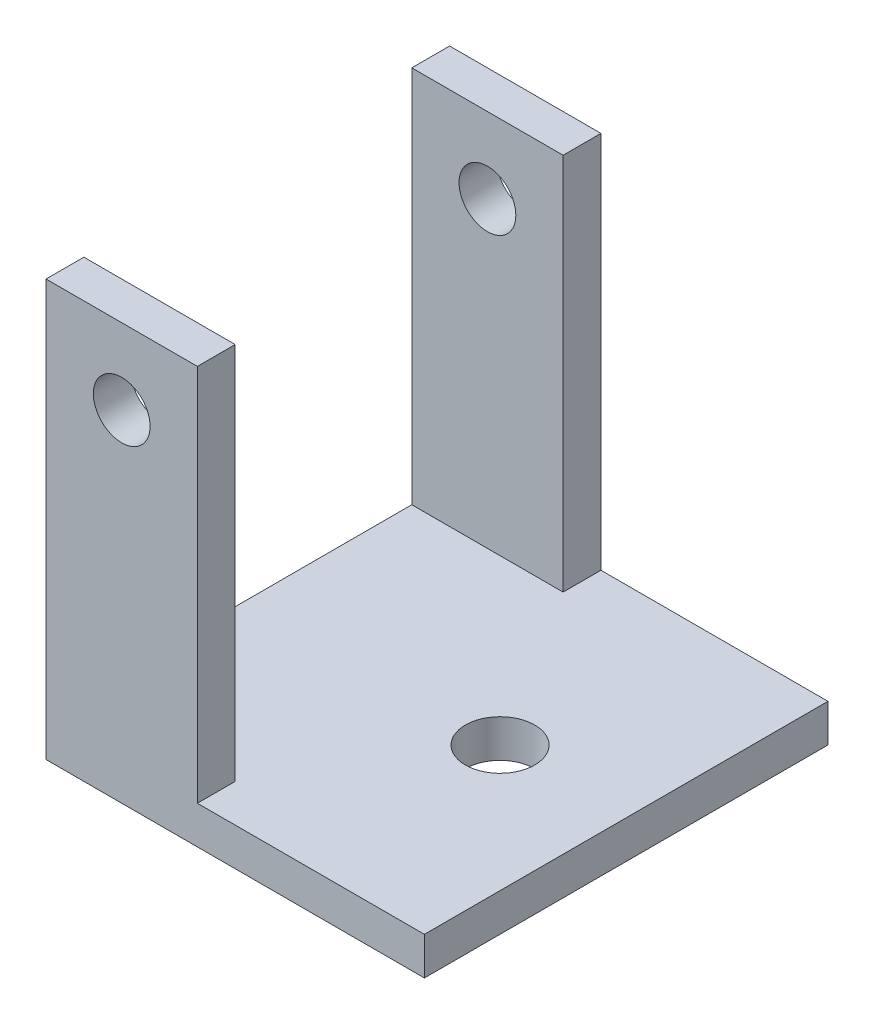
ISO-10303-21;
HEADER;
FILE_DESCRIPTION(('STEP AP214'),'2;1');
FILE_NAME('part.step','',(''),(''),'','','');
FILE_SCHEMA(('AUTOMOTIVE_DESIGN { 1 0 10303 214 1 1 1 1 }'));
ENDSEC;
DATA;
#1=APPLICATION_CONTEXT('core data for automotive mechanical design processes');
#2=APPLICATION_PROTOCOL_DEFINITION('international standard','automotive_design',2000,#1);
#3=PRODUCT_CONTEXT('',#1,'mechanical');
#4=PRODUCT('Part','Part','',(#3));
#5=PRODUCT_RELATED_PRODUCT_CATEGORY('part','',(#4));
#6=PRODUCT_DEFINITION_FORMATION('','',#4);
#7=PRODUCT_DEFINITION_CONTEXT('part definition',#1,'design');
#8=PRODUCT_DEFINITION('design','',#6,#7);
#9=PRODUCT_DEFINITION_SHAPE('','',#8);
#10=(LENGTH_UNIT() NAMED_UNIT(*) SI_UNIT(.MILLI.,.METRE.));
#11=(NAMED_UNIT(*) PLANE_ANGLE_UNIT() SI_UNIT($,.RADIAN.));
#12=(NAMED_UNIT(*) SI_UNIT($,.STERADIAN.) SOLID_ANGLE_UNIT());
#13=UNCERTAINTY_MEASURE_WITH_UNIT(LENGTH_MEASURE(1.E-05),#10,'distance_accuracy_value','');
#14=(GEOMETRIC_REPRESENTATION_CONTEXT(3) GLOBAL_UNCERTAINTY_ASSIGNED_CONTEXT((#13)) GLOBAL_UNIT_ASSIGNED_CONTEXT((#10,
#11,#12)) REPRESENTATION_CONTEXT('',''));
#15=CARTESIAN_POINT('',(0.,0.,0.));
#16=DIRECTION('',(0.,0.,1.));
#17=DIRECTION('',(1.,0.,0.));
#18=AXIS2_PLACEMENT_3D('',#15,#16,#17);
#19=CARTESIAN_POINT('',(0.,0.,0.));
#20=DIRECTION('',(0.,0.,1.));
#21=DIRECTION('',(1.,0.,0.));
#22=AXIS2_PLACEMENT_3D('',#19,#20,#21);
#23=PLANE('',#22);
#24=CARTESIAN_POINT('',(6.,24.,0.));
#25=DIRECTION('',(0.,0.,1.));
#26=DIRECTION('',(1.,0.,0.));
#27=AXIS2_PLACEMENT_3D('',#24,#25,#26);
#28=CIRCLE('',#27,2.25);
#29=CARTESIAN_POINT('',(8.24999999999999,24.,0.));
#30=VERTEX_POINT('',#29);
#31=EDGE_CURVE('E219',#30,#30,#28,.T.);
#32=ORIENTED_EDGE('',*,*,#31,.T.);
#33=EDGE_LOOP('',(#32));
#34=FACE_BOUND('',#33,.T.);
#35=DIRECTION('',(1.,0.,0.));
#36=VECTOR('',#35,1.);
#37=CARTESIAN_POINT('',(0.,0.,0.));
#38=LINE('',#37,#36);
#39=CARTESIAN_POINT('',(0.,0.,0.));
#40=VERTEX_POINT('',#39);
#41=CARTESIAN_POINT('',(12.,0.,0.));
#42=VERTEX_POINT('',#41);
#43=EDGE_CURVE('E49',#40,#42,#38,.T.);
#44=ORIENTED_EDGE('',*,*,#43,.F.);
#45=DIRECTION('',(0.,1.,0.));
#46=VECTOR('',#45,1.);
#47=CARTESIAN_POINT('',(0.,0.,0.));
#48=LINE('',#47,#46);
#49=CARTESIAN_POINT('',(0.,30.,0.));
#50=VERTEX_POINT('',#49);
#51=EDGE_CURVE('E74',#40,#50,#48,.T.);
#52=ORIENTED_EDGE('',*,*,#51,.T.);
#53=DIRECTION('',(1.,0.,0.));
#54=VECTOR('',#53,1.);
#55=CARTESIAN_POINT('',(0.,30.,0.));
#56=LINE('',#55,#54);
#57=CARTESIAN_POINT('',(12.,30.,0.));
#58=VERTEX_POINT('',#57);
#59=EDGE_CURVE('E125',#50,#58,#56,.T.);
#60=ORIENTED_EDGE('',*,*,#59,.T.);
#61=DIRECTION('',(0.,1.,0.));
#62=VECTOR('',#61,1.);
#63=CARTESIAN_POINT('',(12.,0.,0.));
#64=LINE('',#63,#62);
#65=EDGE_CURVE('E122',#42,#58,#64,.T.);
#66=ORIENTED_EDGE('',*,*,#65,.F.);
#67=EDGE_LOOP('',(#44,#52,#60,#66));
#68=FACE_BOUND('',#67,.T.);
#69=ADVANCED_FACE('F34',(#34,#68),#23,.F.);
#70=CARTESIAN_POINT('',(0.,0.,3.));
#71=DIRECTION('',(-1.,0.,0.));
#72=DIRECTION('',(0.,0.,1.));
#73=AXIS2_PLACEMENT_3D('',#70,#71,#72);
#74=PLANE('',#73);
#75=ORIENTED_EDGE('',*,*,#51,.F.);
#76=DIRECTION('',(0.,0.,1.));
#77=VECTOR('',#76,1.);
#78=CARTESIAN_POINT('',(0.,0.,-13.));
#79=LINE('',#78,#77);
#80=CARTESIAN_POINT('',(0.,0.,-26.));
#81=VERTEX_POINT('',#80);
#82=EDGE_CURVE('E123',#81,#40,#79,.T.);
#83=ORIENTED_EDGE('',*,*,#82,.F.);
#84=DIRECTION('',(0.,1.,0.));
#85=VECTOR('',#84,1.);
#86=CARTESIAN_POINT('',(0.,0.,-26.));
#87=LINE('',#86,#85);
#88=CARTESIAN_POINT('',(0.,30.,-26.));
#89=VERTEX_POINT('',#88);
#90=EDGE_CURVE('E168',#81,#89,#87,.T.);
#91=ORIENTED_EDGE('',*,*,#90,.T.);
#92=DIRECTION('',(0.,0.,1.));
#93=VECTOR('',#92,1.);
#94=CARTESIAN_POINT('',(0.,30.,-29.));
#95=LINE('',#94,#93);
#96=CARTESIAN_POINT('',(0.,30.,-29.));
#97=VERTEX_POINT('',#96);
#98=EDGE_CURVE('E167',#97,#89,#95,.T.);
#99=ORIENTED_EDGE('',*,*,#98,.F.);
#100=DIRECTION('',(0.,1.,0.));
#101=VECTOR('',#100,1.);
#102=CARTESIAN_POINT('',(0.,0.,-29.));
#103=LINE('',#102,#101);
#104=CARTESIAN_POINT('',(0.,-3.,-29.));
#105=VERTEX_POINT('',#104);
#106=EDGE_CURVE('E154',#105,#97,#103,.T.);
#107=ORIENTED_EDGE('',*,*,#106,.F.);
#108=DIRECTION('',(0.,0.,-1.));
#109=VECTOR('',#108,1.);
#110=CARTESIAN_POINT('',(0.,-3.,3.));
#111=LINE('',#110,#109);
#112=CARTESIAN_POINT('',(0.,-3.,3.));
#113=VERTEX_POINT('',#112);
#114=EDGE_CURVE('E11',#113,#105,#111,.T.);
#115=ORIENTED_EDGE('',*,*,#114,.F.);
#116=DIRECTION('',(0.,1.,0.));
#117=VECTOR('',#116,1.);
#118=CARTESIAN_POINT('',(0.,0.,3.));
#119=LINE('',#118,#117);
#120=CARTESIAN_POINT('',(0.,30.,3.));
#121=VERTEX_POINT('',#120);
#122=EDGE_CURVE('E127',#113,#121,#119,.T.);
#123=ORIENTED_EDGE('',*,*,#122,.T.);
#124=DIRECTION('',(0.,0.,-1.));
#125=VECTOR('',#124,1.);
#126=CARTESIAN_POINT('',(0.,30.,3.));
#127=LINE('',#126,#125);
#128=EDGE_CURVE('E58',#121,#50,#127,.T.);
#129=ORIENTED_EDGE('',*,*,#128,.T.);
#130=EDGE_LOOP('',(#75,#83,#91,#99,#107,#115,#123,#129));
#131=FACE_BOUND('',#130,.T.);
#132=ADVANCED_FACE('F36',(#131),#74,.T.);
#133=CARTESIAN_POINT('',(0.,-3.,3.));
#134=DIRECTION('',(0.,1.,0.));
#135=DIRECTION('',(0.,0.,1.));
#136=AXIS2_PLACEMENT_3D('',#133,#134,#135);
#137=PLANE('',#136);
#138=CARTESIAN_POINT('',(20.,-3.,-13.));
#139=DIRECTION('',(0.,1.,0.));
#140=DIRECTION('',(0.,0.,1.));
#141=AXIS2_PLACEMENT_3D('',#138,#139,#140);
#142=CIRCLE('',#141,2.75);
#143=CARTESIAN_POINT('',(20.,-3.,-10.25));
#144=VERTEX_POINT('',#143);
#145=EDGE_CURVE('E213',#144,#144,#142,.T.);
#146=ORIENTED_EDGE('',*,*,#145,.T.);
#147=EDGE_LOOP('',(#146));
#148=FACE_BOUND('',#147,.T.);
#149=ORIENTED_EDGE('',*,*,#114,.T.);
#150=DIRECTION('',(1.,0.,0.));
#151=VECTOR('',#150,1.);
#152=CARTESIAN_POINT('',(0.,-3.,-29.));
#153=LINE('',#152,#151);
#154=CARTESIAN_POINT('',(30.,-3.,-29.));
#155=VERTEX_POINT('',#154);
#156=EDGE_CURVE('E148',#105,#155,#153,.T.);
#157=ORIENTED_EDGE('',*,*,#156,.T.);
#158=DIRECTION('',(0.,0.,-1.));
#159=VECTOR('',#158,1.);
#160=CARTESIAN_POINT('',(30.,-3.,3.));
#161=LINE('',#160,#159);
#162=CARTESIAN_POINT('',(30.,-3.,3.));
#163=VERTEX_POINT('',#162);
#164=EDGE_CURVE('E42',#163,#155,#161,.T.);
#165=ORIENTED_EDGE('',*,*,#164,.F.);
#166=DIRECTION('',(1.,0.,0.));
#167=VECTOR('',#166,1.);
#168=CARTESIAN_POINT('',(0.,-3.,3.));
#169=LINE('',#168,#167);
#170=EDGE_CURVE('E116',#113,#163,#169,.T.);
#171=ORIENTED_EDGE('',*,*,#170,.F.);
#172=EDGE_LOOP('',(#149,#157,#165,#171));
#173=FACE_BOUND('',#172,.T.);
#174=ADVANCED_FACE('F153',(#148,#173),#137,.F.);
#175=CARTESIAN_POINT('',(30.,0.,3.));
#176=DIRECTION('',(1.,0.,0.));
#177=DIRECTION('',(0.,0.,-1.));
#178=AXIS2_PLACEMENT_3D('',#175,#176,#177);
#179=PLANE('',#178);
#180=ORIENTED_EDGE('',*,*,#164,.T.);
#181=DIRECTION('',(0.,-1.,0.));
#182=VECTOR('',#181,1.);
#183=CARTESIAN_POINT('',(30.,0.,-29.));
#184=LINE('',#183,#182);
#185=CARTESIAN_POINT('',(30.,0.,-29.));
#186=VERTEX_POINT('',#185);
#187=EDGE_CURVE('E138',#186,#155,#184,.T.);
#188=ORIENTED_EDGE('',*,*,#187,.F.);
#189=DIRECTION('',(0.,0.,-1.));
#190=VECTOR('',#189,1.);
#191=CARTESIAN_POINT('',(30.,0.,3.));
#192=LINE('',#191,#190);
#193=CARTESIAN_POINT('',(30.,0.,3.));
#194=VERTEX_POINT('',#193);
#195=EDGE_CURVE('E100',#194,#186,#192,.T.);
#196=ORIENTED_EDGE('',*,*,#195,.F.);
#197=DIRECTION('',(0.,-1.,0.));
#198=VECTOR('',#197,1.);
#199=CARTESIAN_POINT('',(30.,0.,3.));
#200=LINE('',#199,#198);
#201=EDGE_CURVE('E114',#194,#163,#200,.T.);
#202=ORIENTED_EDGE('',*,*,#201,.T.);
#203=EDGE_LOOP('',(#180,#188,#196,#202));
#204=FACE_BOUND('',#203,.T.);
#205=ADVANCED_FACE('F136',(#204),#179,.T.);
#206=CARTESIAN_POINT('',(0.,0.,3.));
#207=DIRECTION('',(0.,1.,0.));
#208=DIRECTION('',(0.,0.,1.));
#209=AXIS2_PLACEMENT_3D('',#206,#207,#208);
#210=PLANE('',#209);
#211=CARTESIAN_POINT('',(20.,0.,-13.));
#212=DIRECTION('',(0.,1.,0.));
#213=DIRECTION('',(0.,0.,1.));
#214=AXIS2_PLACEMENT_3D('',#211,#212,#213);
#215=CIRCLE('',#214,2.75);
#216=CARTESIAN_POINT('',(20.,0.,-10.25));
#217=VERTEX_POINT('',#216);
#218=EDGE_CURVE('E215',#217,#217,#215,.T.);
#219=ORIENTED_EDGE('',*,*,#218,.F.);
#220=EDGE_LOOP('',(#219));
#221=FACE_BOUND('',#220,.T.);
#222=ORIENTED_EDGE('',*,*,#195,.T.);
#223=DIRECTION('',(1.,0.,0.));
#224=VECTOR('',#223,1.);
#225=CARTESIAN_POINT('',(0.,0.,-29.));
#226=LINE('',#225,#224);
#227=CARTESIAN_POINT('',(12.,0.,-29.));
#228=VERTEX_POINT('',#227);
#229=EDGE_CURVE('E151',#228,#186,#226,.T.);
#230=ORIENTED_EDGE('',*,*,#229,.F.);
#231=DIRECTION('',(0.,0.,1.));
#232=VECTOR('',#231,1.);
#233=CARTESIAN_POINT('',(12.,0.,-29.));
#234=LINE('',#233,#232);
#235=CARTESIAN_POINT('',(12.,0.,-26.));
#236=VERTEX_POINT('',#235);
#237=EDGE_CURVE('E182',#228,#236,#234,.T.);
#238=ORIENTED_EDGE('',*,*,#237,.T.);
#239=DIRECTION('',(1.,0.,0.));
#240=VECTOR('',#239,1.);
#241=CARTESIAN_POINT('',(0.,0.,-26.));
#242=LINE('',#241,#240);
#243=EDGE_CURVE('E172',#81,#236,#242,.T.);
#244=ORIENTED_EDGE('',*,*,#243,.F.);
#245=ORIENTED_EDGE('',*,*,#82,.T.);
#246=ORIENTED_EDGE('',*,*,#43,.T.);
#247=DIRECTION('',(0.,0.,-1.));
#248=VECTOR('',#247,1.);
#249=CARTESIAN_POINT('',(12.,0.,3.));
#250=LINE('',#249,#248);
#251=CARTESIAN_POINT('',(12.,0.,3.));
#252=VERTEX_POINT('',#251);
#253=EDGE_CURVE('E91',#252,#42,#250,.T.);
#254=ORIENTED_EDGE('',*,*,#253,.F.);
#255=DIRECTION('',(1.,0.,0.));
#256=VECTOR('',#255,1.);
#257=CARTESIAN_POINT('',(0.,0.,3.));
#258=LINE('',#257,#256);
#259=EDGE_CURVE('E96',#252,#194,#258,.T.);
#260=ORIENTED_EDGE('',*,*,#259,.T.);
#261=EDGE_LOOP('',(#222,#230,#238,#244,#245,#246,#254,#260));
#262=FACE_BOUND('',#261,.T.);
#263=ADVANCED_FACE('F94',(#221,#262),#210,.T.);
#264=CARTESIAN_POINT('',(12.,0.,3.));
#265=DIRECTION('',(-1.,0.,0.));
#266=DIRECTION('',(0.,0.,1.));
#267=AXIS2_PLACEMENT_3D('',#264,#265,#266);
#268=PLANE('',#267);
#269=ORIENTED_EDGE('',*,*,#65,.T.);
#270=DIRECTION('',(0.,0.,-1.));
#271=VECTOR('',#270,1.);
#272=CARTESIAN_POINT('',(12.,30.,3.));
#273=LINE('',#272,#271);
#274=CARTESIAN_POINT('',(12.,30.,3.));
#275=VERTEX_POINT('',#274);
#276=EDGE_CURVE('E101',#275,#58,#273,.T.);
#277=ORIENTED_EDGE('',*,*,#276,.F.);
#278=DIRECTION('',(0.,1.,0.));
#279=VECTOR('',#278,1.);
#280=CARTESIAN_POINT('',(12.,0.,3.));
#281=LINE('',#280,#279);
#282=EDGE_CURVE('E104',#252,#275,#281,.T.);
#283=ORIENTED_EDGE('',*,*,#282,.F.);
#284=ORIENTED_EDGE('',*,*,#253,.T.);
#285=EDGE_LOOP('',(#269,#277,#283,#284));
#286=FACE_BOUND('',#285,.T.);
#287=ADVANCED_FACE('F105',(#286),#268,.F.);
#288=CARTESIAN_POINT('',(0.,30.,3.));
#289=DIRECTION('',(0.,1.,0.));
#290=DIRECTION('',(0.,0.,1.));
#291=AXIS2_PLACEMENT_3D('',#288,#289,#290);
#292=PLANE('',#291);
#293=ORIENTED_EDGE('',*,*,#59,.F.);
#294=ORIENTED_EDGE('',*,*,#128,.F.);
#295=DIRECTION('',(1.,0.,0.));
#296=VECTOR('',#295,1.);
#297=CARTESIAN_POINT('',(0.,30.,3.));
#298=LINE('',#297,#296);
#299=EDGE_CURVE('E108',#121,#275,#298,.T.);
#300=ORIENTED_EDGE('',*,*,#299,.T.);
#301=ORIENTED_EDGE('',*,*,#276,.T.);
#302=EDGE_LOOP('',(#293,#294,#300,#301));
#303=FACE_BOUND('',#302,.T.);
#304=ADVANCED_FACE('F188',(#303),#292,.T.);
#305=CARTESIAN_POINT('',(0.,0.,3.));
#306=DIRECTION('',(0.,0.,1.));
#307=DIRECTION('',(1.,0.,0.));
#308=AXIS2_PLACEMENT_3D('',#305,#306,#307);
#309=PLANE('',#308);
#310=CARTESIAN_POINT('',(6.,24.,3.));
#311=DIRECTION('',(0.,0.,1.));
#312=DIRECTION('',(1.,0.,0.));
#313=AXIS2_PLACEMENT_3D('',#310,#311,#312);
#314=CIRCLE('',#313,2.25);
#315=CARTESIAN_POINT('',(8.25,24.,3.));
#316=VERTEX_POINT('',#315);
#317=EDGE_CURVE('E229',#316,#316,#314,.T.);
#318=ORIENTED_EDGE('',*,*,#317,.F.);
#319=EDGE_LOOP('',(#318));
#320=FACE_BOUND('',#319,.T.);
#321=ORIENTED_EDGE('',*,*,#122,.F.);
#322=ORIENTED_EDGE('',*,*,#170,.T.);
#323=ORIENTED_EDGE('',*,*,#201,.F.);
#324=ORIENTED_EDGE('',*,*,#259,.F.);
#325=ORIENTED_EDGE('',*,*,#282,.T.);
#326=ORIENTED_EDGE('',*,*,#299,.F.);
#327=EDGE_LOOP('',(#321,#322,#323,#324,#325,#326));
#328=FACE_BOUND('',#327,.T.);
#329=ADVANCED_FACE('F112',(#320,#328),#309,.T.);
#330=CARTESIAN_POINT('',(0.,0.,-26.));
#331=DIRECTION('',(0.,0.,-1.));
#332=DIRECTION('',(1.,0.,0.));
#333=AXIS2_PLACEMENT_3D('',#330,#331,#332);
#334=PLANE('',#333);
#335=CARTESIAN_POINT('',(6.,24.,-26.));
#336=DIRECTION('',(0.,0.,-1.));
#337=DIRECTION('',(-1.,0.,0.));
#338=AXIS2_PLACEMENT_3D('',#335,#336,#337);
#339=CIRCLE('',#338,2.25);
#340=CARTESIAN_POINT('',(3.75,24.,-26.));
#341=VERTEX_POINT('',#340);
#342=EDGE_CURVE('E223',#341,#341,#339,.T.);
#343=ORIENTED_EDGE('',*,*,#342,.T.);
#344=EDGE_LOOP('',(#343));
#345=FACE_BOUND('',#344,.T.);
#346=ORIENTED_EDGE('',*,*,#243,.T.);
#347=DIRECTION('',(0.,1.,0.));
#348=VECTOR('',#347,1.);
#349=CARTESIAN_POINT('',(12.,0.,-26.));
#350=LINE('',#349,#348);
#351=CARTESIAN_POINT('',(12.,30.,-26.));
#352=VERTEX_POINT('',#351);
#353=EDGE_CURVE('E171',#236,#352,#350,.T.);
#354=ORIENTED_EDGE('',*,*,#353,.T.);
#355=DIRECTION('',(1.,0.,0.));
#356=VECTOR('',#355,1.);
#357=CARTESIAN_POINT('',(0.,30.,-26.));
#358=LINE('',#357,#356);
#359=EDGE_CURVE('E156',#89,#352,#358,.T.);
#360=ORIENTED_EDGE('',*,*,#359,.F.);
#361=ORIENTED_EDGE('',*,*,#90,.F.);
#362=EDGE_LOOP('',(#346,#354,#360,#361));
#363=FACE_BOUND('',#362,.T.);
#364=ADVANCED_FACE('F237',(#345,#363),#334,.F.);
#365=CARTESIAN_POINT('',(12.,0.,-29.));
#366=DIRECTION('',(-1.,0.,0.));
#367=DIRECTION('',(0.,0.,-1.));
#368=AXIS2_PLACEMENT_3D('',#365,#366,#367);
#369=PLANE('',#368);
#370=ORIENTED_EDGE('',*,*,#353,.F.);
#371=ORIENTED_EDGE('',*,*,#237,.F.);
#372=DIRECTION('',(0.,1.,0.));
#373=VECTOR('',#372,1.);
#374=CARTESIAN_POINT('',(12.,0.,-29.));
#375=LINE('',#374,#373);
#376=CARTESIAN_POINT('',(12.,30.,-29.));
#377=VERTEX_POINT('',#376);
#378=EDGE_CURVE('E161',#228,#377,#375,.T.);
#379=ORIENTED_EDGE('',*,*,#378,.T.);
#380=DIRECTION('',(0.,0.,1.));
#381=VECTOR('',#380,1.);
#382=CARTESIAN_POINT('',(12.,30.,-29.));
#383=LINE('',#382,#381);
#384=EDGE_CURVE('E179',#377,#352,#383,.T.);
#385=ORIENTED_EDGE('',*,*,#384,.T.);
#386=EDGE_LOOP('',(#370,#371,#379,#385));
#387=FACE_BOUND('',#386,.T.);
#388=ADVANCED_FACE('F241',(#387),#369,.F.);
#389=CARTESIAN_POINT('',(0.,30.,-29.));
#390=DIRECTION('',(0.,1.,0.));
#391=DIRECTION('',(0.,0.,-1.));
#392=AXIS2_PLACEMENT_3D('',#389,#390,#391);
#393=PLANE('',#392);
#394=ORIENTED_EDGE('',*,*,#359,.T.);
#395=ORIENTED_EDGE('',*,*,#384,.F.);
#396=DIRECTION('',(1.,0.,0.));
#397=VECTOR('',#396,1.);
#398=CARTESIAN_POINT('',(0.,30.,-29.));
#399=LINE('',#398,#397);
#400=EDGE_CURVE('E164',#97,#377,#399,.T.);
#401=ORIENTED_EDGE('',*,*,#400,.F.);
#402=ORIENTED_EDGE('',*,*,#98,.T.);
#403=EDGE_LOOP('',(#394,#395,#401,#402));
#404=FACE_BOUND('',#403,.T.);
#405=ADVANCED_FACE('F247',(#404),#393,.T.);
#406=CARTESIAN_POINT('',(0.,0.,-29.));
#407=DIRECTION('',(0.,0.,-1.));
#408=DIRECTION('',(1.,0.,0.));
#409=AXIS2_PLACEMENT_3D('',#406,#407,#408);
#410=PLANE('',#409);
#411=CARTESIAN_POINT('',(6.,24.,-29.));
#412=DIRECTION('',(0.,0.,1.));
#413=DIRECTION('',(1.,0.,0.));
#414=AXIS2_PLACEMENT_3D('',#411,#412,#413);
#415=CIRCLE('',#414,2.24999999999999);
#416=CARTESIAN_POINT('',(8.24999999999999,24.,-29.));
#417=VERTEX_POINT('',#416);
#418=EDGE_CURVE('E226',#417,#417,#415,.T.);
#419=ORIENTED_EDGE('',*,*,#418,.T.);
#420=EDGE_LOOP('',(#419));
#421=FACE_BOUND('',#420,.T.);
#422=ORIENTED_EDGE('',*,*,#106,.T.);
#423=ORIENTED_EDGE('',*,*,#400,.T.);
#424=ORIENTED_EDGE('',*,*,#378,.F.);
#425=ORIENTED_EDGE('',*,*,#229,.T.);
#426=ORIENTED_EDGE('',*,*,#187,.T.);
#427=ORIENTED_EDGE('',*,*,#156,.F.);
#428=EDGE_LOOP('',(#422,#423,#424,#425,#426,#427));
#429=FACE_BOUND('',#428,.T.);
#430=ADVANCED_FACE('F147',(#421,#429),#410,.T.);
#431=CARTESIAN_POINT('',(20.,0.,-13.));
#432=DIRECTION('',(0.,1.,0.));
#433=DIRECTION('',(0.,0.,1.));
#434=AXIS2_PLACEMENT_3D('',#431,#432,#433);
#435=CYLINDRICAL_SURFACE('',#434,2.75);
#436=ORIENTED_EDGE('',*,*,#145,.F.);
#437=EDGE_LOOP('',(#436));
#438=FACE_BOUND('',#437,.T.);
#439=ORIENTED_EDGE('',*,*,#218,.T.);
#440=EDGE_LOOP('',(#439));
#441=FACE_BOUND('',#440,.T.);
#442=ADVANCED_FACE('F258',(#438,#441),#435,.F.);
#443=CARTESIAN_POINT('',(6.,24.,3.));
#444=DIRECTION('',(0.,0.,1.));
#445=DIRECTION('',(1.,0.,0.));
#446=AXIS2_PLACEMENT_3D('',#443,#444,#445);
#447=CYLINDRICAL_SURFACE('',#446,2.25);
#448=ORIENTED_EDGE('',*,*,#418,.F.);
#449=EDGE_LOOP('',(#448));
#450=FACE_BOUND('',#449,.T.);
#451=ORIENTED_EDGE('',*,*,#342,.F.);
#452=EDGE_LOOP('',(#451));
#453=FACE_BOUND('',#452,.T.);
#454=ADVANCED_FACE('F284',(#450,#453),#447,.F.);
#455=ORIENTED_EDGE('',*,*,#317,.T.);
#456=EDGE_LOOP('',(#455));
#457=FACE_BOUND('',#456,.T.);
#458=ORIENTED_EDGE('',*,*,#31,.F.);
#459=EDGE_LOOP('',(#458));
#460=FACE_BOUND('',#459,.T.);
#461=ADVANCED_FACE('F233',(#457,#460),#447,.F.);
#462=CLOSED_SHELL('',(#69,#132,#174,#205,#263,#287,#304,#329,#364,#388,#405,#430,#442,#454,#461));
#463=MANIFOLD_SOLID_BREP('B2',#462);
#464=ADVANCED_BREP_SHAPE_REPRESENTATION('',(#18,#463),#14);
#465=SHAPE_DEFINITION_REPRESENTATION(#9,#464);
ENDSEC;
END-ISO-10303-21;
